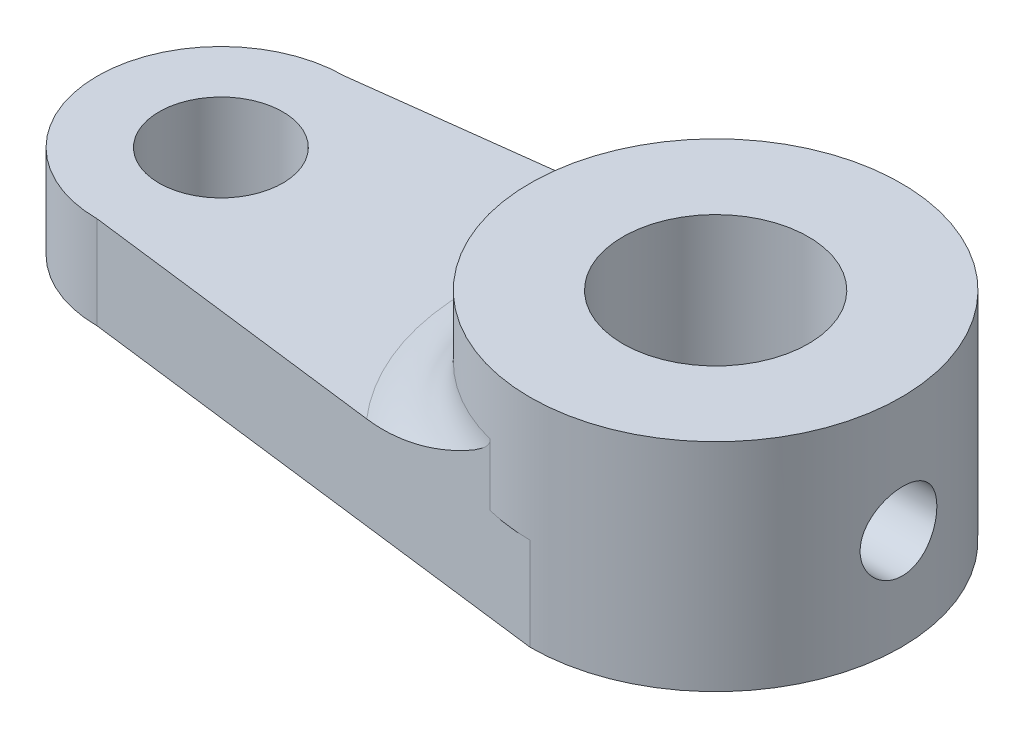
ISO-10303-21;
HEADER;
FILE_DESCRIPTION(('STEP AP214'),'2;1');
FILE_NAME('part.step','',(''),(''),'','','');
FILE_SCHEMA(('AUTOMOTIVE_DESIGN { 1 0 10303 214 1 1 1 1 }'));
ENDSEC;
DATA;
#1=APPLICATION_CONTEXT('core data for automotive mechanical design processes');
#2=APPLICATION_PROTOCOL_DEFINITION('international standard','automotive_design',2000,#1);
#3=PRODUCT_CONTEXT('',#1,'mechanical');
#4=PRODUCT('Part','Part','',(#3));
#5=PRODUCT_RELATED_PRODUCT_CATEGORY('part','',(#4));
#6=PRODUCT_DEFINITION_FORMATION('','',#4);
#7=PRODUCT_DEFINITION_CONTEXT('part definition',#1,'design');
#8=PRODUCT_DEFINITION('design','',#6,#7);
#9=PRODUCT_DEFINITION_SHAPE('','',#8);
#10=(LENGTH_UNIT() NAMED_UNIT(*) SI_UNIT(.MILLI.,.METRE.));
#11=(NAMED_UNIT(*) PLANE_ANGLE_UNIT() SI_UNIT($,.RADIAN.));
#12=(NAMED_UNIT(*) SI_UNIT($,.STERADIAN.) SOLID_ANGLE_UNIT());
#13=UNCERTAINTY_MEASURE_WITH_UNIT(LENGTH_MEASURE(1.E-05),#10,'distance_accuracy_value','');
#14=(GEOMETRIC_REPRESENTATION_CONTEXT(3) GLOBAL_UNCERTAINTY_ASSIGNED_CONTEXT((#13)) GLOBAL_UNIT_ASSIGNED_CONTEXT((#10,
#11,#12)) REPRESENTATION_CONTEXT('',''));
#15=CARTESIAN_POINT('',(0.,0.,0.));
#16=DIRECTION('',(0.,0.,1.));
#17=DIRECTION('',(1.,0.,0.));
#18=AXIS2_PLACEMENT_3D('',#15,#16,#17);
#19=CARTESIAN_POINT('',(-51.4269357454607,3.,0.));
#20=DIRECTION('',(0.,-1.,0.));
#21=DIRECTION('',(0.,0.,-1.));
#22=AXIS2_PLACEMENT_3D('',#19,#20,#21);
#23=CYLINDRICAL_SURFACE('',#22,4.00000000000001);
#24=CARTESIAN_POINT('',(-51.4269357454607,0.,0.));
#25=DIRECTION('',(0.,1.,0.));
#26=DIRECTION('',(0.,0.,1.));
#27=AXIS2_PLACEMENT_3D('',#24,#25,#26);
#28=CIRCLE('',#27,4.00000000000001);
#29=CARTESIAN_POINT('',(-51.4269357454607,0.,-4.00000000000001));
#30=VERTEX_POINT('',#29);
#31=CARTESIAN_POINT('',(-51.4269357454607,0.,4.00000000000001));
#32=VERTEX_POINT('',#31);
#33=EDGE_CURVE('E166',#30,#32,#28,.T.);
#34=ORIENTED_EDGE('',*,*,#33,.T.);
#35=DIRECTION('',(0.,-1.,0.));
#36=VECTOR('',#35,1.);
#37=CARTESIAN_POINT('',(-51.4269357454607,3.,4.00000000000001));
#38=LINE('',#37,#36);
#39=CARTESIAN_POINT('',(-51.4269357454607,3.,4.00000000000001));
#40=VERTEX_POINT('',#39);
#41=EDGE_CURVE('E191',#40,#32,#38,.T.);
#42=ORIENTED_EDGE('',*,*,#41,.F.);
#43=CARTESIAN_POINT('',(-51.4269357454607,3.,0.));
#44=DIRECTION('',(0.,1.,0.));
#45=DIRECTION('',(0.,0.,1.));
#46=AXIS2_PLACEMENT_3D('',#43,#44,#45);
#47=CIRCLE('',#46,4.00000000000001);
#48=CARTESIAN_POINT('',(-51.4269357454607,3.,-4.00000000000001));
#49=VERTEX_POINT('',#48);
#50=EDGE_CURVE('E132',#49,#40,#47,.T.);
#51=ORIENTED_EDGE('',*,*,#50,.F.);
#52=DIRECTION('',(0.,-1.,0.));
#53=VECTOR('',#52,1.);
#54=CARTESIAN_POINT('',(-51.4269357454607,3.,-4.00000000000001));
#55=LINE('',#54,#53);
#56=EDGE_CURVE('E161',#49,#30,#55,.T.);
#57=ORIENTED_EDGE('',*,*,#56,.T.);
#58=EDGE_LOOP('',(#34,#42,#51,#57));
#59=FACE_BOUND('',#58,.T.);
#60=ADVANCED_FACE('F47',(#59),#23,.T.);
#61=CARTESIAN_POINT('',(-1.28349131916093,3.,10.2679305532875));
#62=DIRECTION('',(0.124034734589208,0.,-0.992277876713668));
#63=DIRECTION('',(-0.992277876713668,0.,-0.124034734589208));
#64=AXIS2_PLACEMENT_3D('',#61,#62,#63);
#65=PLANE('',#64);
#66=DIRECTION('',(0.992277876713668,0.,0.124034734589208));
#67=VECTOR('',#66,1.);
#68=CARTESIAN_POINT('',(-1.28349131916093,0.,10.2679305532875));
#69=LINE('',#68,#67);
#70=CARTESIAN_POINT('',(-35.4269357454607,0.,6.));
#71=VERTEX_POINT('',#70);
#72=EDGE_CURVE('E170',#32,#71,#69,.T.);
#73=ORIENTED_EDGE('',*,*,#72,.T.);
#74=DIRECTION('',(0.,-1.,0.));
#75=VECTOR('',#74,1.);
#76=CARTESIAN_POINT('',(-35.4269357454607,3.,6.));
#77=LINE('',#76,#75);
#78=CARTESIAN_POINT('',(-35.4269357454607,3.,6.));
#79=VERTEX_POINT('',#78);
#80=EDGE_CURVE('E128',#79,#71,#77,.T.);
#81=ORIENTED_EDGE('',*,*,#80,.F.);
#82=DIRECTION('',(0.992277876713668,0.,0.124034734589208));
#83=VECTOR('',#82,1.);
#84=CARTESIAN_POINT('',(-1.28349131916093,3.,10.2679305532875));
#85=LINE('',#84,#83);
#86=CARTESIAN_POINT('',(-36.9038588223838,3.,5.81538461538461));
#87=VERTEX_POINT('',#86);
#88=EDGE_CURVE('E126',#87,#79,#85,.T.);
#89=ORIENTED_EDGE('',*,*,#88,.F.);
#90=DIRECTION('',(0.,-1.,0.));
#91=VECTOR('',#90,1.);
#92=CARTESIAN_POINT('',(-36.9038588223838,5.,5.81538461538462));
#93=LINE('',#92,#91);
#94=CARTESIAN_POINT('',(-36.9038588223838,5.,5.81538461538462));
#95=VERTEX_POINT('',#94);
#96=EDGE_CURVE('E113',#95,#87,#93,.T.);
#97=ORIENTED_EDGE('',*,*,#96,.F.);
#98=CARTESIAN_POINT('',(-36.9038588223838,5.,5.81538461538462));
#99=CARTESIAN_POINT('',(-36.9037776142192,4.98206835129727,5.81539476640519));
#100=CARTESIAN_POINT('',(-36.905786389036,4.96428540709011,5.81514366955309));
#101=CARTESIAN_POINT('',(-36.9131020298701,4.92983220472927,5.81422921444883));
#102=CARTESIAN_POINT('',(-36.9183311100127,4.91314568778468,5.813575579431));
#103=CARTESIAN_POINT('',(-36.9339281219909,4.87420948872529,5.81162595293372));
#104=CARTESIAN_POINT('',(-36.9455237209024,4.85248149719556,5.81017650306979));
#105=CARTESIAN_POINT('',(-36.9717983767565,4.81076560975714,5.80689217108803));
#106=CARTESIAN_POINT('',(-36.9865120009805,4.79080110981863,5.80505296806003));
#107=CARTESIAN_POINT('',(-37.0336993134759,4.73272152069167,5.7991545539981));
#108=CARTESIAN_POINT('',(-37.0689373920903,4.69694269160291,5.7947497941713));
#109=CARTESIAN_POINT('',(-37.1425747438481,4.62879824358648,5.78554512520157));
#110=CARTESIAN_POINT('',(-37.1809866960913,4.59644762198182,5.78074363117118));
#111=CARTESIAN_POINT('',(-37.2598295499379,4.53373910686024,5.77088827444036));
#112=CARTESIAN_POINT('',(-37.3002729106165,4.50339709398709,5.76583285435553));
#113=CARTESIAN_POINT('',(-37.3821596795398,4.44433146970119,5.75559700824011));
#114=CARTESIAN_POINT('',(-37.4236008108604,4.41560459540481,5.75041686682504));
#115=CARTESIAN_POINT('',(-37.5481981218196,4.33170775155008,5.73484220295514));
#116=CARTESIAN_POINT('',(-37.6324542402364,4.27819828583966,5.72431018815304));
#117=CARTESIAN_POINT('',(-37.8028155982751,4.17423919749155,5.70301501839821));
#118=CARTESIAN_POINT('',(-37.8889214340673,4.12379058203652,5.69225178892418));
#119=CARTESIAN_POINT('',(-38.0627513197314,4.02544013060177,5.67052305321616));
#120=CARTESIAN_POINT('',(-38.1504779154899,3.97754285995477,5.65955722874635));
#121=CARTESIAN_POINT('',(-38.3272253001602,3.88428321543627,5.63746380566256));
#122=CARTESIAN_POINT('',(-38.4162458923127,3.83892046115486,5.62633623164351));
#123=CARTESIAN_POINT('',(-38.6835773411008,3.70748650409311,5.592919800545));
#124=CARTESIAN_POINT('',(-38.8637342407934,3.62517964425513,5.57040018808341));
#125=CARTESIAN_POINT('',(-39.2287557941327,3.47230141460982,5.524772493916));
#126=CARTESIAN_POINT('',(-39.4136165200617,3.40172060179217,5.50166490317488));
#127=CARTESIAN_POINT('',(-39.7503969205791,3.28746693256513,5.4595673531102));
#128=CARTESIAN_POINT('',(-39.9014575907777,3.24123752816752,5.44068476933538));
#129=CARTESIAN_POINT('',(-40.2063365577063,3.15935265505965,5.4025748984693));
#130=CARTESIAN_POINT('',(-40.3601536572317,3.12369270834048,5.38334776102862));
#131=CARTESIAN_POINT('',(-40.671974572784,3.06438903547158,5.34437014658459));
#132=CARTESIAN_POINT('',(-40.8300062413865,3.04088917160201,5.32461618800928));
#133=CARTESIAN_POINT('',(-41.0683083299534,3.01674380568156,5.29482842693842));
#134=CARTESIAN_POINT('',(-41.1480406990005,3.01054539863812,5.28486188080753));
#135=CARTESIAN_POINT('',(-41.3077447927109,3.00217436340395,5.26489886909373));
#136=CARTESIAN_POINT('',(-41.3877166047203,3.00000344779633,5.25490239259256));
#137=CARTESIAN_POINT('',(-41.4677134017162,3.,5.24490279296806));
#138=B_SPLINE_CURVE_WITH_KNOTS('',3,(#98,#99,#100,#101,#102,#103,#104,#105,#106,#107,#108,#109,
#110,#111,#112,#113,#114,#115,#116,#117,#118,#119,#120,#121,#122,#123,#124,#125,#126,#127,#128,
#129,#130,#131,#132,#133,#134,#135,#136,#137),.UNSPECIFIED.,.F.,.F.,(4,2,2,2,2,2,2,2,2,2,2,2,2,
2,2,2,2,2,2,4),(0.,0.0534457094729916,0.105648500704279,0.179238899339848,0.253692350821773,
0.404347373934474,0.555636393518132,0.708005822765211,0.860055475605072,1.16103965292565,
1.46212233884616,1.76372682895055,2.06528592843868,2.66294892892375,3.26012827234684,
3.73710737769704,4.21388410938358,4.6961794123799,4.93786444212935,5.17965221844568),.UNSPECIFIED.);
#139=CARTESIAN_POINT('',(-41.4677134017162,3.,5.24490279296806));
#140=VERTEX_POINT('',#139);
#141=EDGE_CURVE('E77',#95,#140,#138,.T.);
#142=ORIENTED_EDGE('',*,*,#141,.T.);
#143=EDGE_CURVE('E131',#40,#140,#85,.T.);
#144=ORIENTED_EDGE('',*,*,#143,.F.);
#145=ORIENTED_EDGE('',*,*,#41,.T.);
#146=EDGE_LOOP('',(#73,#81,#89,#97,#142,#144,#145));
#147=FACE_BOUND('',#146,.T.);
#148=ADVANCED_FACE('F127',(#147),#65,.F.);
#149=CARTESIAN_POINT('',(-35.4269357454607,3.,0.));
#150=DIRECTION('',(0.,-1.,0.));
#151=DIRECTION('',(0.,0.,-1.));
#152=AXIS2_PLACEMENT_3D('',#149,#150,#151);
#153=CYLINDRICAL_SURFACE('',#152,6.);
#154=CARTESIAN_POINT('',(-29.5681665904388,3.23141181860407,-1.2941499094634));
#155=CARTESIAN_POINT('',(-29.5681651767372,3.16202120345304,-1.29414742881346));
#156=CARTESIAN_POINT('',(-29.5668788101629,3.09259984658886,-1.28836173598642));
#157=CARTESIAN_POINT('',(-29.5618770297642,2.95572550128683,-1.26539294348063));
#158=CARTESIAN_POINT('',(-29.558159754003,2.88827406309765,-1.24820110720436));
#159=CARTESIAN_POINT('',(-29.548723931507,2.75733944576921,-1.2029776923604));
#160=CARTESIAN_POINT('',(-29.5430074648581,2.69385222261227,-1.17495737726388));
#161=CARTESIAN_POINT('',(-29.5302021737929,2.57248731895848,-1.1089003949146));
#162=CARTESIAN_POINT('',(-29.5231134048453,2.51460941187406,-1.07086413248556));
#163=CARTESIAN_POINT('',(-29.5082168410768,2.40521644345061,-0.985228939843465));
#164=CARTESIAN_POINT('',(-29.5004004925463,2.35379992497761,-0.937505595144853));
#165=CARTESIAN_POINT('',(-29.48496805444,2.25965074995598,-0.834114530918505));
#166=CARTESIAN_POINT('',(-29.4773519795875,2.21691873031264,-0.778446229231393));
#167=CARTESIAN_POINT('',(-29.4630554091306,2.14096593052122,-0.660085416753923));
#168=CARTESIAN_POINT('',(-29.4563844813903,2.10783929214082,-0.597331241412101));
#169=CARTESIAN_POINT('',(-29.4447788245382,2.0526457657443,-0.466984053359274));
#170=CARTESIAN_POINT('',(-29.4398439189485,2.03057775345055,-0.399391533338458));
#171=CARTESIAN_POINT('',(-29.4322849397745,1.99843605748661,-0.262306676545013));
#172=CARTESIAN_POINT('',(-29.4296289132632,1.98819580140891,-0.192855182927468));
#173=CARTESIAN_POINT('',(-29.4267648847452,1.97948012284706,-0.0531712558041264));
#174=CARTESIAN_POINT('',(-29.4265566276484,1.98100347441098,0.0170610955623306));
#175=CARTESIAN_POINT('',(-29.4285508143273,1.99564641956082,0.1551665319449));
#176=CARTESIAN_POINT('',(-29.4307160728071,2.0085865375622,0.223059302175266));
#177=CARTESIAN_POINT('',(-29.4371204959673,2.04541044393538,0.35570390145352));
#178=CARTESIAN_POINT('',(-29.4413597484851,2.06929469580716,0.420455597343894));
#179=CARTESIAN_POINT('',(-29.4514515051152,2.12749187072958,0.545483444563183));
#180=CARTESIAN_POINT('',(-29.4573147076388,2.16187411281374,0.605726428449484));
#181=CARTESIAN_POINT('',(-29.4699752380546,2.24003982144449,0.719661306292768));
#182=CARTESIAN_POINT('',(-29.4767726820453,2.28382445681021,0.773352384474521));
#183=CARTESIAN_POINT('',(-29.4906718348276,2.38053344349513,0.873722253854681));
#184=CARTESIAN_POINT('',(-29.4977768660044,2.43361487858602,0.920249353832001));
#185=CARTESIAN_POINT('',(-29.5113415606066,2.54689386759888,1.00376334057345));
#186=CARTESIAN_POINT('',(-29.5178012096543,2.60709157999131,1.04075001482602));
#187=CARTESIAN_POINT('',(-29.5293246733543,2.73312407343287,1.10418778893323));
#188=CARTESIAN_POINT('',(-29.5343849852369,2.79897246929751,1.13061252278951));
#189=CARTESIAN_POINT('',(-29.5424686622607,2.93430343797346,1.17196228092918));
#190=CARTESIAN_POINT('',(-29.5454923176561,3.00378549141217,1.18688894390451));
#191=CARTESIAN_POINT('',(-29.5490914440075,3.14303152492298,1.20458593479062));
#192=CARTESIAN_POINT('',(-29.5497112582394,3.2127664031411,1.20757647692344));
#193=CARTESIAN_POINT('',(-29.5485498885588,3.35173763014421,1.20191007705507));
#194=CARTESIAN_POINT('',(-29.5467688531943,3.42097400950641,1.19325385567532));
#195=CARTESIAN_POINT('',(-29.5410537497241,3.55623233466219,1.16473123032884));
#196=CARTESIAN_POINT('',(-29.5371425933921,3.6222804857829,1.14498405227782));
#197=CARTESIAN_POINT('',(-29.527640623515,3.75013580804567,1.09497078494242));
#198=CARTESIAN_POINT('',(-29.5220496617105,3.81194260425447,1.06470376714107));
#199=CARTESIAN_POINT('',(-29.5097385765788,3.9305182598203,0.994021004256382));
#200=CARTESIAN_POINT('',(-29.5030036760961,3.98720402307024,0.953468490270472));
#201=CARTESIAN_POINT('',(-29.4892305375253,4.09305506775913,0.863551350681972));
#202=CARTESIAN_POINT('',(-29.4821922654938,4.1422195048433,0.814185737054294));
#203=CARTESIAN_POINT('',(-29.4684938621946,4.23247453170123,0.707056789406189));
#204=CARTESIAN_POINT('',(-29.4618420506526,4.27341591363045,0.649166520798777));
#205=CARTESIAN_POINT('',(-29.4498296272677,4.34500057069205,0.527210811603102));
#206=CARTESIAN_POINT('',(-29.4444689583767,4.37564430084152,0.463145644022965));
#207=CARTESIAN_POINT('',(-29.435711880289,4.42555049792141,0.331040967820381));
#208=CARTESIAN_POINT('',(-29.4323037344927,4.44488098414841,0.263027971591258));
#209=CARTESIAN_POINT('',(-29.4278315550969,4.47182622261216,0.124647065509634));
#210=CARTESIAN_POINT('',(-29.4267672139054,4.4794425121368,0.0542794658971508));
#211=CARTESIAN_POINT('',(-29.4271445357641,4.48267944065258,-0.085390805191794));
#212=CARTESIAN_POINT('',(-29.4285392909728,4.4785237185988,-0.154688516534548));
#213=CARTESIAN_POINT('',(-29.4336323768297,4.45883117995114,-0.291557326434124));
#214=CARTESIAN_POINT('',(-29.4373306733041,4.4432945321973,-0.359128450590087));
#215=CARTESIAN_POINT('',(-29.4466546164829,4.40138402395551,-0.490474010050509));
#216=CARTESIAN_POINT('',(-29.4522751005745,4.37503915475096,-0.554258083552012));
#217=CARTESIAN_POINT('',(-29.4648806066408,4.31228942087207,-0.676520654151196));
#218=CARTESIAN_POINT('',(-29.4718657474122,4.27588368026093,-0.734998688696317));
#219=CARTESIAN_POINT('',(-29.4866219814126,4.19330215061076,-0.846091514706384));
#220=CARTESIAN_POINT('',(-29.4944046260951,4.14696753054737,-0.898586716163121));
#221=CARTESIAN_POINT('',(-29.509832940344,4.04616731760699,-0.995133394800143));
#222=CARTESIAN_POINT('',(-29.5174785768083,3.99169978865564,-1.03918285571657));
#223=CARTESIAN_POINT('',(-29.5318953303723,3.87540271617063,-1.11809253947768));
#224=CARTESIAN_POINT('',(-29.5386549805114,3.81349340714198,-1.15283739076839));
#225=CARTESIAN_POINT('',(-29.5504198334654,3.68458666252081,-1.21138746574517));
#226=CARTESIAN_POINT('',(-29.5554265809033,3.61759377015106,-1.23520232650497));
#227=CARTESIAN_POINT('',(-29.562167441756,3.49730553703564,-1.26675984457007));
#228=CARTESIAN_POINT('',(-29.5644031080962,3.44468228201102,-1.27701225062344));
#229=CARTESIAN_POINT('',(-29.5674031984273,3.33851603808306,-1.29070810339489));
#230=CARTESIAN_POINT('',(-29.5681676816477,3.28497308629403,-1.2941518242289));
#231=CARTESIAN_POINT('',(-29.5681665904388,3.23141181860407,-1.2941499094634));
#232=B_SPLINE_CURVE_WITH_KNOTS('',3,(#154,#155,#156,#157,#158,#159,#160,#161,#162,#163,#164,
#165,#166,#167,#168,#169,#170,#171,#172,#173,#174,#175,#176,#177,#178,#179,#180,#181,#182,#183,
#184,#185,#186,#187,#188,#189,#190,#191,#192,#193,#194,#195,#196,#197,#198,#199,#200,#201,#202,
#203,#204,#205,#206,#207,#208,#209,#210,#211,#212,#213,#214,#215,#216,#217,#218,#219,#220,#221,
#222,#223,#224,#225,#226,#227,#228,#229,#230,#231),.UNSPECIFIED.,.T.,.F.,(4,2,2,2,2,2,2,2,2,2,2,
2,2,2,2,2,2,2,2,2,2,2,2,2,2,2,2,2,2,2,2,2,2,2,2,2,2,2,4),(0.,0.207975654071268,
0.416110792417469,0.624030014802726,0.831940834815787,1.04271333467884,1.25350128663873,
1.46629026266843,1.67905760106932,1.88879048859263,2.09850151896338,2.3049734141646,
2.51145405455869,2.71932871977948,2.92722924104259,3.13905862244912,3.35089272191626,
3.56325237332486,3.77558175387595,3.9839751600979,4.19235567296522,4.3985378623192,
4.60473825464029,4.81383917934649,5.02296356082183,5.23559458753341,5.44821621759038,
5.65954599648532,5.87084803959578,6.07816293922642,6.28547476332978,6.49223410585098,
6.69901145528171,6.9093831897857,7.11980508427532,7.3327265135812,7.54545984571985,
7.70599867585766,7.86653104261157),.UNSPECIFIED.);
#233=CARTESIAN_POINT('',(-29.5681665904388,3.23141181860407,-1.2941499094634));
#234=VERTEX_POINT('',#233);
#235=EDGE_CURVE('E11',#234,#234,#232,.T.);
#236=ORIENTED_EDGE('',*,*,#235,.T.);
#237=EDGE_LOOP('',(#236));
#238=FACE_BOUND('',#237,.T.);
#239=CARTESIAN_POINT('',(-35.4269357454607,5.,0.));
#240=DIRECTION('',(0.,1.,0.));
#241=DIRECTION('',(0.,0.,1.));
#242=AXIS2_PLACEMENT_3D('',#239,#240,#241);
#243=CIRCLE('',#242,6.);
#244=CARTESIAN_POINT('',(-36.9038588223838,5.,-5.81538461538462));
#245=VERTEX_POINT('',#244);
#246=EDGE_CURVE('E121',#245,#95,#243,.T.);
#247=ORIENTED_EDGE('',*,*,#246,.T.);
#248=ORIENTED_EDGE('',*,*,#96,.T.);
#249=CARTESIAN_POINT('',(-35.4269357454607,3.,0.));
#250=DIRECTION('',(0.,1.,0.));
#251=DIRECTION('',(0.,0.,1.));
#252=AXIS2_PLACEMENT_3D('',#249,#250,#251);
#253=CIRCLE('',#252,6.);
#254=EDGE_CURVE('E119',#87,#79,#253,.T.);
#255=ORIENTED_EDGE('',*,*,#254,.T.);
#256=ORIENTED_EDGE('',*,*,#80,.T.);
#257=CARTESIAN_POINT('',(-35.4269357454607,0.,0.));
#258=DIRECTION('',(0.,1.,0.));
#259=DIRECTION('',(0.,0.,1.));
#260=AXIS2_PLACEMENT_3D('',#257,#258,#259);
#261=CIRCLE('',#260,6.);
#262=CARTESIAN_POINT('',(-35.4269357454607,0.,-6.));
#263=VERTEX_POINT('',#262);
#264=EDGE_CURVE('E173',#71,#263,#261,.T.);
#265=ORIENTED_EDGE('',*,*,#264,.T.);
#266=DIRECTION('',(0.,-1.,0.));
#267=VECTOR('',#266,1.);
#268=CARTESIAN_POINT('',(-35.4269357454607,3.,-6.));
#269=LINE('',#268,#267);
#270=CARTESIAN_POINT('',(-35.4269357454607,3.,-6.));
#271=VERTEX_POINT('',#270);
#272=EDGE_CURVE('E186',#271,#263,#269,.T.);
#273=ORIENTED_EDGE('',*,*,#272,.F.);
#274=CARTESIAN_POINT('',(-36.9038588223838,3.,-5.81538461538461));
#275=VERTEX_POINT('',#274);
#276=EDGE_CURVE('E136',#271,#275,#253,.T.);
#277=ORIENTED_EDGE('',*,*,#276,.T.);
#278=DIRECTION('',(0.,-1.,0.));
#279=VECTOR('',#278,1.);
#280=CARTESIAN_POINT('',(-36.9038588223838,3.,-5.81538461538461));
#281=LINE('',#280,#279);
#282=EDGE_CURVE('E69',#275,#245,#281,.F.);
#283=ORIENTED_EDGE('',*,*,#282,.T.);
#284=EDGE_LOOP('',(#247,#248,#255,#256,#265,#273,#277,#283));
#285=FACE_BOUND('',#284,.T.);
#286=CARTESIAN_POINT('',(-35.4269357454607,7.,0.));
#287=DIRECTION('',(0.,1.,0.));
#288=DIRECTION('',(0.,0.,1.));
#289=AXIS2_PLACEMENT_3D('',#286,#287,#288);
#290=CIRCLE('',#289,6.);
#291=CARTESIAN_POINT('',(-35.4269357454607,7.,6.));
#292=VERTEX_POINT('',#291);
#293=EDGE_CURVE('E141',#292,#292,#290,.T.);
#294=ORIENTED_EDGE('',*,*,#293,.F.);
#295=EDGE_LOOP('',(#294));
#296=FACE_BOUND('',#295,.T.);
#297=ADVANCED_FACE('F115',(#238,#285,#296),#153,.T.);
#298=CARTESIAN_POINT('',(-1.28349131916093,3.,-10.2679305532875));
#299=DIRECTION('',(-0.124034734589208,0.,-0.992277876713668));
#300=DIRECTION('',(-0.992277876713668,0.,0.124034734589208));
#301=AXIS2_PLACEMENT_3D('',#298,#299,#300);
#302=PLANE('',#301);
#303=DIRECTION('',(0.992277876713668,0.,-0.124034734589208));
#304=VECTOR('',#303,1.);
#305=CARTESIAN_POINT('',(-1.28349131916093,0.,-10.2679305532875));
#306=LINE('',#305,#304);
#307=EDGE_CURVE('E177',#30,#263,#306,.T.);
#308=ORIENTED_EDGE('',*,*,#307,.F.);
#309=ORIENTED_EDGE('',*,*,#56,.F.);
#310=DIRECTION('',(0.992277876713668,0.,-0.124034734589208));
#311=VECTOR('',#310,1.);
#312=CARTESIAN_POINT('',(-1.28349131916093,3.,-10.2679305532875));
#313=LINE('',#312,#311);
#314=CARTESIAN_POINT('',(-41.4677134017162,3.,-5.24490279296806));
#315=VERTEX_POINT('',#314);
#316=EDGE_CURVE('E157',#49,#315,#313,.T.);
#317=ORIENTED_EDGE('',*,*,#316,.T.);
#318=CARTESIAN_POINT('',(-41.4677134017162,3.,-5.24490279296806));
#319=CARTESIAN_POINT('',(-41.3219242954281,3.00003666719876,-5.26312643125407));
#320=CARTESIAN_POINT('',(-41.1762961170415,3.00721748276434,-5.28132995355241));
#321=CARTESIAN_POINT('',(-40.8864278196868,3.03411812202512,-5.31756349072174));
#322=CARTESIAN_POINT('',(-40.7421856604022,3.05381515322618,-5.33559376063232));
#323=CARTESIAN_POINT('',(-40.4565771480068,3.10384401837015,-5.37129482468175));
#324=CARTESIAN_POINT('',(-40.315198022974,3.13410395623439,-5.38896721531084));
#325=CARTESIAN_POINT('',(-40.0346691802779,3.20386765252683,-5.42403332064785));
#326=CARTESIAN_POINT('',(-39.8955203701714,3.24337507676749,-5.44142692191117));
#327=CARTESIAN_POINT('',(-39.5788923552583,3.3432510217201,-5.48100542377531));
#328=CARTESIAN_POINT('',(-39.4022591753044,3.40633293535076,-5.50308457126954));
#329=CARTESIAN_POINT('',(-39.0532300926811,3.54367923274424,-5.54671320659745));
#330=CARTESIAN_POINT('',(-38.8808372679494,3.61795147588234,-5.56826230968892));
#331=CARTESIAN_POINT('',(-38.5901376027031,3.75293656937011,-5.60459976784471));
#332=CARTESIAN_POINT('',(-38.4707348767675,3.81127708891283,-5.61952510858665));
#333=CARTESIAN_POINT('',(-38.2341848974484,3.93242034598619,-5.64909385600154));
#334=CARTESIAN_POINT('',(-38.117037436469,3.99522267029002,-5.66373728862396));
#335=CARTESIAN_POINT('',(-37.9231834079756,4.10415455562155,-5.68796904218564));
#336=CARTESIAN_POINT('',(-37.8457762974779,4.14902263064007,-5.69764493099785));
#337=CARTESIAN_POINT('',(-37.6923921540503,4.24111940695813,-5.71681794892631));
#338=CARTESIAN_POINT('',(-37.6164144690161,4.28834699404335,-5.72631515955558));
#339=CARTESIAN_POINT('',(-37.4922026561972,4.36919475866765,-5.74184163615795));
#340=CARTESIAN_POINT('',(-37.4433962905257,4.40192206577083,-5.74794243186688));
#341=CARTESIAN_POINT('',(-37.3469510152376,4.46924400295126,-5.75999809127789));
#342=CARTESIAN_POINT('',(-37.2993136897191,4.50384098308617,-5.7659527569677));
#343=CARTESIAN_POINT('',(-37.2109236103109,4.57203994747652,-5.77700151689373));
#344=CARTESIAN_POINT('',(-37.1699679793533,4.60537560389929,-5.78212097076342));
#345=CARTESIAN_POINT('',(-37.0910165332544,4.67548838589802,-5.79198990152579));
#346=CARTESIAN_POINT('',(-37.0530140267347,4.71225728933227,-5.79674021484075));
#347=CARTESIAN_POINT('',(-37.0040095622335,4.76883231980866,-5.80286577290341));
#348=CARTESIAN_POINT('',(-36.9901497956049,4.78608005134936,-5.80459824373197));
#349=CARTESIAN_POINT('',(-36.9643541786682,4.82201840915203,-5.80782269584906));
#350=CARTESIAN_POINT('',(-36.9524174632299,4.84070838095968,-5.80931478527885));
#351=CARTESIAN_POINT('',(-36.9341444179278,4.87497867747792,-5.81159891594161));
#352=CARTESIAN_POINT('',(-36.9271525708966,4.89019717688798,-5.81247289682051));
#353=CARTESIAN_POINT('',(-36.9156223728405,4.92152861095998,-5.81391417157753));
#354=CARTESIAN_POINT('',(-36.9110741120681,4.93763763624524,-5.81448270417408));
#355=CARTESIAN_POINT('',(-36.9066900101515,4.96159214755093,-5.81503071691365));
#356=CARTESIAN_POINT('',(-36.9056353858112,4.96921917574478,-5.81516254495619));
#357=CARTESIAN_POINT('',(-36.9042169726736,4.98456220309282,-5.81533984659839));
#358=CARTESIAN_POINT('',(-36.9038553868745,4.99227840778437,-5.81538504482328));
#359=CARTESIAN_POINT('',(-36.9038588223838,5.,-5.81538461538462));
#360=B_SPLINE_CURVE_WITH_KNOTS('',3,(#318,#319,#320,#321,#322,#323,#324,#325,#326,#327,#328,
#329,#330,#331,#332,#333,#334,#335,#336,#337,#338,#339,#340,#341,#342,#343,#344,#345,#346,#347,
#348,#349,#350,#351,#352,#353,#354,#355,#356,#357,#358,#359),.UNSPECIFIED.,.F.,.F.,(4,2,2,2,2,2,
2,2,2,2,2,2,2,2,2,2,2,2,2,2,4),(0.,0.440365794165006,0.879931955049912,1.31656275509205,
1.75336693473425,2.3194667336781,2.88596599463606,3.28706789905174,3.68813270400983,
3.95808072117703,4.22790244603647,4.40511886635725,4.58256346573584,4.74168004718302,
4.90042488980729,4.96692652863707,5.03339816608035,5.08356423332926,5.13352529074198,
5.15659859168335,5.17974511609009),.UNSPECIFIED.);
#361=EDGE_CURVE('E62',#315,#245,#360,.T.);
#362=ORIENTED_EDGE('',*,*,#361,.T.);
#363=ORIENTED_EDGE('',*,*,#282,.F.);
#364=EDGE_CURVE('E156',#275,#271,#313,.T.);
#365=ORIENTED_EDGE('',*,*,#364,.T.);
#366=ORIENTED_EDGE('',*,*,#272,.T.);
#367=EDGE_LOOP('',(#308,#309,#317,#362,#363,#365,#366));
#368=FACE_BOUND('',#367,.T.);
#369=ADVANCED_FACE('F221',(#368),#302,.T.);
#370=CARTESIAN_POINT('',(-51.4269357454607,3.,0.));
#371=DIRECTION('',(0.,-1.,0.));
#372=DIRECTION('',(0.,0.,-1.));
#373=AXIS2_PLACEMENT_3D('',#370,#371,#372);
#374=CYLINDRICAL_SURFACE('',#373,2.);
#375=CARTESIAN_POINT('',(-51.4269357454607,3.,0.));
#376=DIRECTION('',(0.,1.,0.));
#377=DIRECTION('',(0.,0.,1.));
#378=AXIS2_PLACEMENT_3D('',#375,#376,#377);
#379=CIRCLE('',#378,2.);
#380=CARTESIAN_POINT('',(-51.4269357454607,3.,2.));
#381=VERTEX_POINT('',#380);
#382=EDGE_CURVE('E147',#381,#381,#379,.T.);
#383=ORIENTED_EDGE('',*,*,#382,.T.);
#384=EDGE_LOOP('',(#383));
#385=FACE_BOUND('',#384,.T.);
#386=CARTESIAN_POINT('',(-51.4269357454607,0.,0.));
#387=DIRECTION('',(0.,1.,0.));
#388=DIRECTION('',(0.,0.,1.));
#389=AXIS2_PLACEMENT_3D('',#386,#387,#388);
#390=CIRCLE('',#389,2.);
#391=CARTESIAN_POINT('',(-51.4269357454607,0.,2.));
#392=VERTEX_POINT('',#391);
#393=EDGE_CURVE('E162',#392,#392,#390,.T.);
#394=ORIENTED_EDGE('',*,*,#393,.F.);
#395=EDGE_LOOP('',(#394));
#396=FACE_BOUND('',#395,.T.);
#397=ADVANCED_FACE('F218',(#385,#396),#374,.F.);
#398=CARTESIAN_POINT('',(-35.4269357454607,3.,0.));
#399=DIRECTION('',(0.,-1.,0.));
#400=DIRECTION('',(0.,0.,-1.));
#401=AXIS2_PLACEMENT_3D('',#398,#399,#400);
#402=CYLINDRICAL_SURFACE('',#401,3.);
#403=CARTESIAN_POINT('',(-32.709246817459,3.23141181860407,-1.27049867792796));
#404=CARTESIAN_POINT('',(-32.7092395949008,3.16473992770722,-1.27049132276693));
#405=CARTESIAN_POINT('',(-32.7067259033718,3.09795916177786,-1.26514954617341));
#406=CARTESIAN_POINT('',(-32.696986544319,2.96632487654693,-1.24398702882699));
#407=CARTESIAN_POINT('',(-32.6897480818907,2.90147709192884,-1.22813783164732));
#408=CARTESIAN_POINT('',(-32.6715234953771,2.775850688913,-1.18668022147615));
#409=CARTESIAN_POINT('',(-32.6605526671575,2.71505665488906,-1.16111159095607));
#410=CARTESIAN_POINT('',(-32.6361054415218,2.59865236902602,-1.10105096548141));
#411=CARTESIAN_POINT('',(-32.6226296370195,2.54304089517096,-1.06656108138248));
#412=CARTESIAN_POINT('',(-32.5937318775028,2.43508609363061,-0.987334296150826));
#413=CARTESIAN_POINT('',(-32.5782430134344,2.38310425985998,-0.942128992645972));
#414=CARTESIAN_POINT('',(-32.5475639491316,2.28721159610652,-0.843725636843569));
#415=CARTESIAN_POINT('',(-32.5323738660573,2.24330387799107,-0.790524517152477));
#416=CARTESIAN_POINT('',(-32.5031783263145,2.1629622877248,-0.674796765021966));
#417=CARTESIAN_POINT('',(-32.4892528289366,2.12693519057173,-0.611965734997009));
#418=CARTESIAN_POINT('',(-32.464904084754,2.06613579809847,-0.480448067896661));
#419=CARTESIAN_POINT('',(-32.4544792837957,2.04135850663986,-0.411764046314699));
#420=CARTESIAN_POINT('',(-32.4387409710199,2.00507235984734,-0.274275692751757));
#421=CARTESIAN_POINT('',(-32.4331897026596,1.99294012370203,-0.205663623920994));
#422=CARTESIAN_POINT('',(-32.4268881684928,1.98027417744422,-0.0671697492545645));
#423=CARTESIAN_POINT('',(-32.426135955384,1.97973576272112,0.00271153003162103));
#424=CARTESIAN_POINT('',(-32.429366243903,1.9899460995374,0.137226663675757));
#425=CARTESIAN_POINT('',(-32.4330633813861,2.00000991912981,0.201921043394679));
#426=CARTESIAN_POINT('',(-32.4443115966576,2.02996492124224,0.328634733333157));
#427=CARTESIAN_POINT('',(-32.4518629585593,2.04985682823424,0.390653845980389));
#428=CARTESIAN_POINT('',(-32.4702029293106,2.09913985949872,0.511390085092687));
#429=CARTESIAN_POINT('',(-32.4810391705552,2.1286712814749,0.570042397463771));
#430=CARTESIAN_POINT('',(-32.5048627361575,2.19625757530442,0.681729531623117));
#431=CARTESIAN_POINT('',(-32.5178508203107,2.23431545944907,0.734762358340989));
#432=CARTESIAN_POINT('',(-32.545729896978,2.3209942390087,0.837670803107372));
#433=CARTESIAN_POINT('',(-32.5606904896833,2.37017060988309,0.887060373560617));
#434=CARTESIAN_POINT('',(-32.5901197169317,2.47612325931066,0.977099488944607));
#435=CARTESIAN_POINT('',(-32.6045881598296,2.53290245689617,1.0177456612303));
#436=CARTESIAN_POINT('',(-32.6318303897621,2.65480685526599,1.0903872356627));
#437=CARTESIAN_POINT('',(-32.6445328518212,2.72014502434736,1.12205441674374));
#438=CARTESIAN_POINT('',(-32.6659216737789,2.85589286357858,1.17370871375229));
#439=CARTESIAN_POINT('',(-32.6746109043696,2.92629886687362,1.19370418124671));
#440=CARTESIAN_POINT('',(-32.6862585209985,3.06530862751808,1.22019908767397));
#441=CARTESIAN_POINT('',(-32.6895521512224,3.13373294086313,1.22748998817015));
#442=CARTESIAN_POINT('',(-32.6909889135822,3.27089030101558,1.23069105578044));
#443=CARTESIAN_POINT('',(-32.6891338275975,3.33962323279579,1.22660516020034));
#444=CARTESIAN_POINT('',(-32.6808318412996,3.47081020403452,1.20789240296063));
#445=CARTESIAN_POINT('',(-32.6746865249832,3.53338450539088,1.19395714970539));
#446=CARTESIAN_POINT('',(-32.6588904632603,3.65526311510195,1.15686156020469));
#447=CARTESIAN_POINT('',(-32.6492388985386,3.71456665543478,1.13369906768128));
#448=CARTESIAN_POINT('',(-32.6270337452196,3.83102712896054,1.0777240762305));
#449=CARTESIAN_POINT('',(-32.6143745668225,3.8879867932144,1.04454444424304));
#450=CARTESIAN_POINT('',(-32.5877527975444,3.99581987110309,0.969850831361136));
#451=CARTESIAN_POINT('',(-32.5737896439417,4.04669063530594,0.928333243303604));
#452=CARTESIAN_POINT('',(-32.5447870407171,4.14521195348808,0.834167148622809));
#453=CARTESIAN_POINT('',(-32.5297525099028,4.19226321855473,0.780887642563433));
#454=CARTESIAN_POINT('',(-32.5013982549273,4.2768841105834,0.666842769317456));
#455=CARTESIAN_POINT('',(-32.4880786564736,4.31445304266777,0.606076854002374));
#456=CARTESIAN_POINT('',(-32.4646074499166,4.37900169404764,0.478363580827956));
#457=CARTESIAN_POINT('',(-32.4544640388156,4.40595405989355,0.411400797335669));
#458=CARTESIAN_POINT('',(-32.4386110125018,4.4480286109385,0.273366185699658));
#459=CARTESIAN_POINT('',(-32.4328987585449,4.46315783683014,0.202296830147761));
#460=CARTESIAN_POINT('',(-32.4268577676074,4.48026994412437,0.063429437758459));
#461=CARTESIAN_POINT('',(-32.4261806392197,4.48309781830103,-0.00425002783144812));
#462=CARTESIAN_POINT('',(-32.4294025877413,4.47779867731013,-0.139060486304268));
#463=CARTESIAN_POINT('',(-32.4333008624026,4.4696735825912,-0.206191573261522));
#464=CARTESIAN_POINT('',(-32.445077044914,4.44330574644541,-0.335547706969176));
#465=CARTESIAN_POINT('',(-32.4528088756154,4.42543213813452,-0.39786231244996));
#466=CARTESIAN_POINT('',(-32.4714614333062,4.38047757139494,-0.518559983245668));
#467=CARTESIAN_POINT('',(-32.4823827660022,4.35339486393916,-0.576942299199839));
#468=CARTESIAN_POINT('',(-32.5069977842771,4.2894222893896,-0.691029638487662));
#469=CARTESIAN_POINT('',(-32.5207944559778,4.25214451718007,-0.746494422073411));
#470=CARTESIAN_POINT('',(-32.5495431599943,4.16940463573217,-0.850607929485796));
#471=CARTESIAN_POINT('',(-32.5644956200382,4.12393948819732,-0.899254111002878));
#472=CARTESIAN_POINT('',(-32.5951747121995,4.02246699274966,-0.991799463547717));
#473=CARTESIAN_POINT('',(-32.6108847894012,3.96595280398295,-1.03515037080184));
#474=CARTESIAN_POINT('',(-32.6402728052433,3.84595307792387,-1.11184683913334));
#475=CARTESIAN_POINT('',(-32.6539496057503,3.78246367054592,-1.14518680712108));
#476=CARTESIAN_POINT('',(-32.6774717964457,3.65046798358132,-1.20056360391464));
#477=CARTESIAN_POINT('',(-32.687337486061,3.58199065981086,-1.22266052310593));
#478=CARTESIAN_POINT('',(-32.7018983230965,3.4418722447534,-1.25478912716823));
#479=CARTESIAN_POINT('',(-32.7066108089294,3.37024261132977,-1.26486128099533));
#480=CARTESIAN_POINT('',(-32.7089705738395,3.27605329434218,-1.2699053903053));
#481=CARTESIAN_POINT('',(-32.7092492361232,3.25373866121604,-1.27050114099779));
#482=CARTESIAN_POINT('',(-32.709246817459,3.23141181860407,-1.27049867792796));
#483=B_SPLINE_CURVE_WITH_KNOTS('',3,(#403,#404,#405,#406,#407,#408,#409,#410,#411,#412,#413,
#414,#415,#416,#417,#418,#419,#420,#421,#422,#423,#424,#425,#426,#427,#428,#429,#430,#431,#432,
#433,#434,#435,#436,#437,#438,#439,#440,#441,#442,#443,#444,#445,#446,#447,#448,#449,#450,#451,
#452,#453,#454,#455,#456,#457,#458,#459,#460,#461,#462,#463,#464,#465,#466,#467,#468,#469,#470,
#471,#472,#473,#474,#475,#476,#477,#478,#479,#480,#481,#482),.UNSPECIFIED.,.T.,.F.,(4,2,2,2,2,2,
2,2,2,2,2,2,2,2,2,2,2,2,2,2,2,2,2,2,2,2,2,2,2,2,2,2,2,2,2,2,2,2,2,4),(0.,0.199951711985514,
0.400447161842174,0.60013065215211,0.799766938550097,1.01066841430653,1.2216510045991,
1.44178476577923,1.6618206677489,1.87040605977951,2.07890680917929,2.27471840245092,
2.47054443201882,2.66935814640064,2.86824221022483,3.08114531844483,3.29413040441365,
3.5141154566672,3.73394290745567,3.93950778306306,4.14500152518447,4.3373390106619,
4.52972146913528,4.73025126818167,4.93086800795463,5.14781662735512,5.36478114041864,
5.58230105955592,5.79969134643005,6.00188635094051,6.20404590801912,6.39903415036485,
6.5940594463217,6.79789862829034,7.00181361048901,7.21960426908074,7.43751638139186,
7.65425125796862,7.87025464546159,7.93721375436702),.UNSPECIFIED.);
#484=CARTESIAN_POINT('',(-32.709246817459,3.23141181860407,-1.27049867792796));
#485=VERTEX_POINT('',#484);
#486=EDGE_CURVE('E143',#485,#485,#483,.T.);
#487=ORIENTED_EDGE('',*,*,#486,.F.);
#488=EDGE_LOOP('',(#487));
#489=FACE_BOUND('',#488,.T.);
#490=CARTESIAN_POINT('',(-35.4269357454607,0.,0.));
#491=DIRECTION('',(0.,1.,0.));
#492=DIRECTION('',(0.,0.,1.));
#493=AXIS2_PLACEMENT_3D('',#490,#491,#492);
#494=CIRCLE('',#493,3.);
#495=CARTESIAN_POINT('',(-35.4269357454607,0.,3.));
#496=VERTEX_POINT('',#495);
#497=EDGE_CURVE('E151',#496,#496,#494,.T.);
#498=ORIENTED_EDGE('',*,*,#497,.F.);
#499=EDGE_LOOP('',(#498));
#500=FACE_BOUND('',#499,.T.);
#501=CARTESIAN_POINT('',(-35.4269357454607,7.,0.));
#502=DIRECTION('',(0.,1.,0.));
#503=DIRECTION('',(0.,0.,1.));
#504=AXIS2_PLACEMENT_3D('',#501,#502,#503);
#505=CIRCLE('',#504,3.);
#506=CARTESIAN_POINT('',(-35.4269357454607,7.,3.));
#507=VERTEX_POINT('',#506);
#508=EDGE_CURVE('E137',#507,#507,#505,.T.);
#509=ORIENTED_EDGE('',*,*,#508,.T.);
#510=EDGE_LOOP('',(#509));
#511=FACE_BOUND('',#510,.T.);
#512=ADVANCED_FACE('F220',(#489,#500,#511),#402,.F.);
#513=CARTESIAN_POINT('',(0.,3.,0.));
#514=DIRECTION('',(0.,1.,0.));
#515=DIRECTION('',(0.,0.,1.));
#516=AXIS2_PLACEMENT_3D('',#513,#514,#515);
#517=PLANE('',#516);
#518=ORIENTED_EDGE('',*,*,#143,.T.);
#519=CARTESIAN_POINT('',(-35.4269357454607,3.,0.));
#520=DIRECTION('',(0.,1.,0.));
#521=DIRECTION('',(0.,0.,1.));
#522=AXIS2_PLACEMENT_3D('',#519,#520,#521);
#523=CIRCLE('',#522,8.);
#524=EDGE_CURVE('E123',#140,#315,#523,.F.);
#525=ORIENTED_EDGE('',*,*,#524,.T.);
#526=ORIENTED_EDGE('',*,*,#316,.F.);
#527=ORIENTED_EDGE('',*,*,#50,.T.);
#528=EDGE_LOOP('',(#518,#525,#526,#527));
#529=FACE_BOUND('',#528,.T.);
#530=ORIENTED_EDGE('',*,*,#382,.F.);
#531=EDGE_LOOP('',(#530));
#532=FACE_BOUND('',#531,.T.);
#533=ADVANCED_FACE('F227',(#529,#532),#517,.T.);
#534=CARTESIAN_POINT('',(0.,0.,0.));
#535=DIRECTION('',(0.,1.,0.));
#536=DIRECTION('',(0.,0.,1.));
#537=AXIS2_PLACEMENT_3D('',#534,#535,#536);
#538=PLANE('',#537);
#539=ORIENTED_EDGE('',*,*,#393,.T.);
#540=EDGE_LOOP('',(#539));
#541=FACE_BOUND('',#540,.T.);
#542=ORIENTED_EDGE('',*,*,#33,.F.);
#543=ORIENTED_EDGE('',*,*,#307,.T.);
#544=ORIENTED_EDGE('',*,*,#264,.F.);
#545=ORIENTED_EDGE('',*,*,#72,.F.);
#546=EDGE_LOOP('',(#542,#543,#544,#545));
#547=FACE_BOUND('',#546,.T.);
#548=ORIENTED_EDGE('',*,*,#497,.T.);
#549=EDGE_LOOP('',(#548));
#550=FACE_BOUND('',#549,.T.);
#551=ADVANCED_FACE('F234',(#541,#547,#550),#538,.F.);
#552=CARTESIAN_POINT('',(-35.4269357454607,3.,0.));
#553=DIRECTION('',(0.,1.,0.));
#554=DIRECTION('',(0.,0.,1.));
#555=AXIS2_PLACEMENT_3D('',#552,#553,#554);
#556=PLANE('',#555);
#557=ORIENTED_EDGE('',*,*,#254,.F.);
#558=ORIENTED_EDGE('',*,*,#88,.T.);
#559=EDGE_LOOP('',(#557,#558));
#560=FACE_BOUND('',#559,.T.);
#561=ADVANCED_FACE('F134',(#560),#556,.F.);
#562=CARTESIAN_POINT('',(-35.4269357454607,7.,0.));
#563=DIRECTION('',(0.,1.,0.));
#564=DIRECTION('',(0.,0.,1.));
#565=AXIS2_PLACEMENT_3D('',#562,#563,#564);
#566=PLANE('',#565);
#567=ORIENTED_EDGE('',*,*,#293,.T.);
#568=EDGE_LOOP('',(#567));
#569=FACE_BOUND('',#568,.T.);
#570=ORIENTED_EDGE('',*,*,#508,.F.);
#571=EDGE_LOOP('',(#570));
#572=FACE_BOUND('',#571,.T.);
#573=ADVANCED_FACE('F246',(#569,#572),#566,.T.);
#574=ORIENTED_EDGE('',*,*,#364,.F.);
#575=ORIENTED_EDGE('',*,*,#276,.F.);
#576=EDGE_LOOP('',(#574,#575));
#577=FACE_BOUND('',#576,.T.);
#578=ADVANCED_FACE('F248',(#577),#556,.F.);
#579=CARTESIAN_POINT('',(-35.4269357454607,5.,0.));
#580=DIRECTION('',(0.,1.,0.));
#581=DIRECTION('',(0.,0.,1.));
#582=AXIS2_PLACEMENT_3D('',#579,#580,#581);
#583=TOROIDAL_SURFACE('',#582,8.,2.);
#584=ORIENTED_EDGE('',*,*,#361,.F.);
#585=ORIENTED_EDGE('',*,*,#524,.F.);
#586=ORIENTED_EDGE('',*,*,#141,.F.);
#587=ORIENTED_EDGE('',*,*,#246,.F.);
#588=EDGE_LOOP('',(#584,#585,#586,#587));
#589=FACE_BOUND('',#588,.T.);
#590=ADVANCED_FACE('F49',(#589),#583,.F.);
#591=CARTESIAN_POINT('',(-29.4271058250701,3.23141181860407,-0.0451766132554548));
#592=DIRECTION('',(0.99997165339844,0.,-0.00752943554257571));
#593=DIRECTION('',(-0.00752943554257571,0.,-0.99997165339844));
#594=AXIS2_PLACEMENT_3D('',#591,#592,#593);
#595=CYLINDRICAL_SURFACE('',#594,1.24999999999999);
#596=ORIENTED_EDGE('',*,*,#486,.T.);
#597=EDGE_LOOP('',(#596));
#598=FACE_BOUND('',#597,.T.);
#599=ORIENTED_EDGE('',*,*,#235,.F.);
#600=EDGE_LOOP('',(#599));
#601=FACE_BOUND('',#600,.T.);
#602=ADVANCED_FACE('F258',(#598,#601),#595,.F.);
#603=CLOSED_SHELL('',(#60,#148,#297,#369,#397,#512,#533,#551,#561,#573,#578,#590,#602));
#604=MANIFOLD_SOLID_BREP('B2',#603);
#605=ADVANCED_BREP_SHAPE_REPRESENTATION('',(#18,#604),#14);
#606=SHAPE_DEFINITION_REPRESENTATION(#9,#605);
ENDSEC;
END-ISO-10303-21;
